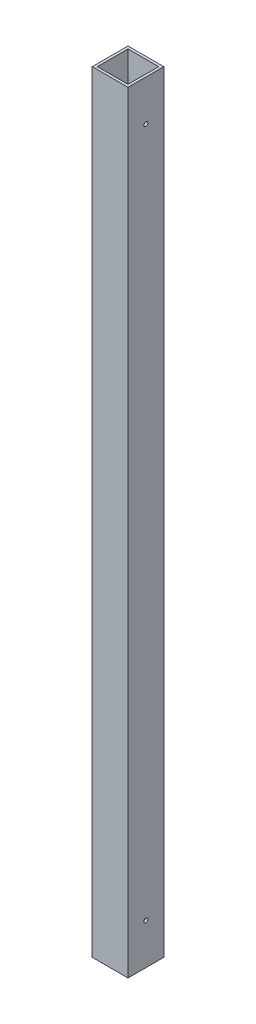
ISO-10303-21;
HEADER;
FILE_DESCRIPTION(('STEP AP214'),'2;1');
FILE_NAME('part.step','',(''),(''),'','','');
FILE_SCHEMA(('AUTOMOTIVE_DESIGN { 1 0 10303 214 1 1 1 1 }'));
ENDSEC;
DATA;
#1=APPLICATION_CONTEXT('core data for automotive mechanical design processes');
#2=APPLICATION_PROTOCOL_DEFINITION('international standard','automotive_design',2000,#1);
#3=PRODUCT_CONTEXT('',#1,'mechanical');
#4=PRODUCT('Part','Part','',(#3));
#5=PRODUCT_RELATED_PRODUCT_CATEGORY('part','',(#4));
#6=PRODUCT_DEFINITION_FORMATION('','',#4);
#7=PRODUCT_DEFINITION_CONTEXT('part definition',#1,'design');
#8=PRODUCT_DEFINITION('design','',#6,#7);
#9=PRODUCT_DEFINITION_SHAPE('','',#8);
#10=(LENGTH_UNIT() NAMED_UNIT(*) SI_UNIT(.MILLI.,.METRE.));
#11=(NAMED_UNIT(*) PLANE_ANGLE_UNIT() SI_UNIT($,.RADIAN.));
#12=(NAMED_UNIT(*) SI_UNIT($,.STERADIAN.) SOLID_ANGLE_UNIT());
#13=UNCERTAINTY_MEASURE_WITH_UNIT(LENGTH_MEASURE(1.E-05),#10,'distance_accuracy_value','');
#14=(GEOMETRIC_REPRESENTATION_CONTEXT(3) GLOBAL_UNCERTAINTY_ASSIGNED_CONTEXT((#13)) GLOBAL_UNIT_ASSIGNED_CONTEXT((#10,
#11,#12)) REPRESENTATION_CONTEXT('',''));
#15=CARTESIAN_POINT('',(0.,0.,0.));
#16=DIRECTION('',(0.,0.,1.));
#17=DIRECTION('',(1.,0.,0.));
#18=AXIS2_PLACEMENT_3D('',#15,#16,#17);
#19=CARTESIAN_POINT('',(1071.54310144857,-428.625,22.225));
#20=DIRECTION('',(1.,0.,0.));
#21=DIRECTION('',(0.,0.,-1.));
#22=AXIS2_PLACEMENT_3D('',#19,#20,#21);
#23=CYLINDRICAL_SURFACE('',#22,2.4892);
#24=CARTESIAN_POINT('',(3.17499999999993,-428.625,22.225));
#25=DIRECTION('',(1.,0.,0.));
#26=DIRECTION('',(0.,0.,-1.));
#27=AXIS2_PLACEMENT_3D('',#24,#25,#26);
#28=CIRCLE('',#27,2.4892);
#29=CARTESIAN_POINT('',(3.17499999999993,-428.625,19.7358));
#30=VERTEX_POINT('',#29);
#31=EDGE_CURVE('E17',#30,#30,#28,.T.);
#32=ORIENTED_EDGE('',*,*,#31,.T.);
#33=EDGE_LOOP('',(#32));
#34=FACE_BOUND('',#33,.T.);
#35=CARTESIAN_POINT('',(0.,-428.625,22.225));
#36=DIRECTION('',(1.,0.,0.));
#37=DIRECTION('',(0.,0.,-1.));
#38=AXIS2_PLACEMENT_3D('',#35,#36,#37);
#39=CIRCLE('',#38,2.4892);
#40=CARTESIAN_POINT('',(0.,-428.625,19.7358));
#41=VERTEX_POINT('',#40);
#42=EDGE_CURVE('E129',#41,#41,#39,.T.);
#43=ORIENTED_EDGE('',*,*,#42,.F.);
#44=EDGE_LOOP('',(#43));
#45=FACE_BOUND('',#44,.T.);
#46=ADVANCED_FACE('F14',(#34,#45),#23,.F.);
#47=CARTESIAN_POINT('',(1071.54310144857,428.625,22.225));
#48=DIRECTION('',(1.,0.,0.));
#49=DIRECTION('',(0.,0.,-1.));
#50=AXIS2_PLACEMENT_3D('',#47,#48,#49);
#51=CYLINDRICAL_SURFACE('',#50,2.4892);
#52=CARTESIAN_POINT('',(3.17499999999993,428.625,22.225));
#53=DIRECTION('',(1.,0.,0.));
#54=DIRECTION('',(0.,0.,-1.));
#55=AXIS2_PLACEMENT_3D('',#52,#53,#54);
#56=CIRCLE('',#55,2.4892);
#57=CARTESIAN_POINT('',(3.17499999999993,428.625,19.7358));
#58=VERTEX_POINT('',#57);
#59=EDGE_CURVE('E117',#58,#58,#56,.T.);
#60=ORIENTED_EDGE('',*,*,#59,.T.);
#61=EDGE_LOOP('',(#60));
#62=FACE_BOUND('',#61,.T.);
#63=CARTESIAN_POINT('',(0.,428.625,22.225));
#64=DIRECTION('',(1.,0.,0.));
#65=DIRECTION('',(0.,0.,-1.));
#66=AXIS2_PLACEMENT_3D('',#63,#64,#65);
#67=CIRCLE('',#66,2.4892);
#68=CARTESIAN_POINT('',(0.,428.625,19.7358));
#69=VERTEX_POINT('',#68);
#70=EDGE_CURVE('E125',#69,#69,#67,.T.);
#71=ORIENTED_EDGE('',*,*,#70,.F.);
#72=EDGE_LOOP('',(#71));
#73=FACE_BOUND('',#72,.T.);
#74=ADVANCED_FACE('F154',(#62,#73),#51,.F.);
#75=CARTESIAN_POINT('',(22.225,-479.425,3.175));
#76=DIRECTION('',(0.,0.,1.));
#77=DIRECTION('',(1.,0.,0.));
#78=AXIS2_PLACEMENT_3D('',#75,#76,#77);
#79=PLANE('',#78);
#80=DIRECTION('',(1.,0.,0.));
#81=VECTOR('',#80,1.);
#82=CARTESIAN_POINT('',(22.225,-479.425,3.175));
#83=LINE('',#82,#81);
#84=CARTESIAN_POINT('',(41.275,-479.425,3.175));
#85=VERTEX_POINT('',#84);
#86=CARTESIAN_POINT('',(3.175,-479.425,3.175));
#87=VERTEX_POINT('',#86);
#88=EDGE_CURVE('E305',#85,#87,#83,.F.);
#89=ORIENTED_EDGE('',*,*,#88,.F.);
#90=DIRECTION('',(0.,1.,0.));
#91=VECTOR('',#90,1.);
#92=CARTESIAN_POINT('',(41.275,-479.425,3.175));
#93=LINE('',#92,#91);
#94=CARTESIAN_POINT('',(41.275,479.425,3.175));
#95=VERTEX_POINT('',#94);
#96=EDGE_CURVE('E101',#95,#85,#93,.F.);
#97=ORIENTED_EDGE('',*,*,#96,.F.);
#98=DIRECTION('',(1.,0.,0.));
#99=VECTOR('',#98,1.);
#100=CARTESIAN_POINT('',(22.225,479.425,3.175));
#101=LINE('',#100,#99);
#102=CARTESIAN_POINT('',(3.175,479.425,3.175));
#103=VERTEX_POINT('',#102);
#104=EDGE_CURVE('E105',#95,#103,#101,.F.);
#105=ORIENTED_EDGE('',*,*,#104,.T.);
#106=DIRECTION('',(0.,1.,0.));
#107=VECTOR('',#106,1.);
#108=CARTESIAN_POINT('',(3.175,-479.425,3.175));
#109=LINE('',#108,#107);
#110=EDGE_CURVE('E115',#103,#87,#109,.F.);
#111=ORIENTED_EDGE('',*,*,#110,.T.);
#112=EDGE_LOOP('',(#89,#97,#105,#111));
#113=FACE_BOUND('',#112,.T.);
#114=ADVANCED_FACE('F145',(#113),#79,.T.);
#115=CARTESIAN_POINT('',(3.175,-479.425,22.225));
#116=DIRECTION('',(-1.,0.,0.));
#117=DIRECTION('',(0.,0.,1.));
#118=AXIS2_PLACEMENT_3D('',#115,#116,#117);
#119=PLANE('',#118);
#120=DIRECTION('',(0.,1.,0.));
#121=VECTOR('',#120,1.);
#122=CARTESIAN_POINT('',(3.175,-479.425,41.275));
#123=LINE('',#122,#121);
#124=CARTESIAN_POINT('',(3.175,479.425,41.275));
#125=VERTEX_POINT('',#124);
#126=CARTESIAN_POINT('',(3.175,-479.425,41.275));
#127=VERTEX_POINT('',#126);
#128=EDGE_CURVE('E77',#125,#127,#123,.F.);
#129=ORIENTED_EDGE('',*,*,#128,.T.);
#130=DIRECTION('',(0.,0.,-1.));
#131=VECTOR('',#130,1.);
#132=CARTESIAN_POINT('',(3.175,-479.425,22.225));
#133=LINE('',#132,#131);
#134=EDGE_CURVE('E316',#87,#127,#133,.F.);
#135=ORIENTED_EDGE('',*,*,#134,.F.);
#136=ORIENTED_EDGE('',*,*,#110,.F.);
#137=DIRECTION('',(0.,0.,-1.));
#138=VECTOR('',#137,1.);
#139=CARTESIAN_POINT('',(3.175,479.425,22.225));
#140=LINE('',#139,#138);
#141=EDGE_CURVE('E107',#103,#125,#140,.F.);
#142=ORIENTED_EDGE('',*,*,#141,.T.);
#143=EDGE_LOOP('',(#129,#135,#136,#142));
#144=FACE_BOUND('',#143,.T.);
#145=ORIENTED_EDGE('',*,*,#59,.F.);
#146=EDGE_LOOP('',(#145));
#147=FACE_BOUND('',#146,.T.);
#148=ORIENTED_EDGE('',*,*,#31,.F.);
#149=EDGE_LOOP('',(#148));
#150=FACE_BOUND('',#149,.T.);
#151=ADVANCED_FACE('F143',(#144,#147,#150),#119,.F.);
#152=CARTESIAN_POINT('',(22.225,-479.425,41.275));
#153=DIRECTION('',(0.,0.,1.));
#154=DIRECTION('',(1.,0.,0.));
#155=AXIS2_PLACEMENT_3D('',#152,#153,#154);
#156=PLANE('',#155);
#157=DIRECTION('',(0.,1.,0.));
#158=VECTOR('',#157,1.);
#159=CARTESIAN_POINT('',(41.275,-479.425,41.275));
#160=LINE('',#159,#158);
#161=CARTESIAN_POINT('',(41.275,-479.425,41.275));
#162=VERTEX_POINT('',#161);
#163=CARTESIAN_POINT('',(41.275,479.425,41.275));
#164=VERTEX_POINT('',#163);
#165=EDGE_CURVE('E83',#162,#164,#160,.T.);
#166=ORIENTED_EDGE('',*,*,#165,.F.);
#167=DIRECTION('',(1.,0.,0.));
#168=VECTOR('',#167,1.);
#169=CARTESIAN_POINT('',(22.225,-479.425,41.275));
#170=LINE('',#169,#168);
#171=EDGE_CURVE('E314',#127,#162,#170,.T.);
#172=ORIENTED_EDGE('',*,*,#171,.F.);
#173=ORIENTED_EDGE('',*,*,#128,.F.);
#174=DIRECTION('',(1.,0.,0.));
#175=VECTOR('',#174,1.);
#176=CARTESIAN_POINT('',(22.225,479.425,41.275));
#177=LINE('',#176,#175);
#178=EDGE_CURVE('E80',#125,#164,#177,.T.);
#179=ORIENTED_EDGE('',*,*,#178,.T.);
#180=EDGE_LOOP('',(#166,#172,#173,#179));
#181=FACE_BOUND('',#180,.T.);
#182=ADVANCED_FACE('F82',(#181),#156,.F.);
#183=CARTESIAN_POINT('',(41.275,-479.425,22.225));
#184=DIRECTION('',(-1.,0.,0.));
#185=DIRECTION('',(0.,0.,1.));
#186=AXIS2_PLACEMENT_3D('',#183,#184,#185);
#187=PLANE('',#186);
#188=DIRECTION('',(0.,0.,-1.));
#189=VECTOR('',#188,1.);
#190=CARTESIAN_POINT('',(41.275,-479.425,22.225));
#191=LINE('',#190,#189);
#192=EDGE_CURVE('E98',#162,#85,#191,.T.);
#193=ORIENTED_EDGE('',*,*,#192,.F.);
#194=ORIENTED_EDGE('',*,*,#165,.T.);
#195=DIRECTION('',(0.,0.,-1.));
#196=VECTOR('',#195,1.);
#197=CARTESIAN_POINT('',(41.275,479.425,22.225));
#198=LINE('',#197,#196);
#199=EDGE_CURVE('E88',#164,#95,#198,.T.);
#200=ORIENTED_EDGE('',*,*,#199,.T.);
#201=ORIENTED_EDGE('',*,*,#96,.T.);
#202=EDGE_LOOP('',(#193,#194,#200,#201));
#203=FACE_BOUND('',#202,.T.);
#204=CARTESIAN_POINT('',(41.2749999999999,428.625,22.225));
#205=DIRECTION('',(1.,0.,0.));
#206=DIRECTION('',(0.,0.,-1.));
#207=AXIS2_PLACEMENT_3D('',#204,#205,#206);
#208=CIRCLE('',#207,2.4892);
#209=CARTESIAN_POINT('',(41.2749999999999,428.625,19.7358));
#210=VERTEX_POINT('',#209);
#211=EDGE_CURVE('E111',#210,#210,#208,.T.);
#212=ORIENTED_EDGE('',*,*,#211,.T.);
#213=EDGE_LOOP('',(#212));
#214=FACE_BOUND('',#213,.T.);
#215=CARTESIAN_POINT('',(41.2749999999999,-428.625,22.225));
#216=DIRECTION('',(1.,0.,0.));
#217=DIRECTION('',(0.,0.,-1.));
#218=AXIS2_PLACEMENT_3D('',#215,#216,#217);
#219=CIRCLE('',#218,2.4892);
#220=CARTESIAN_POINT('',(41.2749999999999,-428.625,19.7358));
#221=VERTEX_POINT('',#220);
#222=EDGE_CURVE('E100',#221,#221,#219,.T.);
#223=ORIENTED_EDGE('',*,*,#222,.T.);
#224=EDGE_LOOP('',(#223));
#225=FACE_BOUND('',#224,.T.);
#226=ADVANCED_FACE('F93',(#203,#214,#225),#187,.T.);
#227=CARTESIAN_POINT('',(1071.54310144857,-428.625,22.225));
#228=DIRECTION('',(1.,0.,0.));
#229=DIRECTION('',(0.,0.,-1.));
#230=AXIS2_PLACEMENT_3D('',#227,#228,#229);
#231=CYLINDRICAL_SURFACE('',#230,2.4892);
#232=CARTESIAN_POINT('',(44.4500000000001,-428.625,22.225));
#233=DIRECTION('',(1.,0.,0.));
#234=DIRECTION('',(0.,0.,-1.));
#235=AXIS2_PLACEMENT_3D('',#232,#233,#234);
#236=CIRCLE('',#235,2.4892);
#237=CARTESIAN_POINT('',(44.4500000000001,-428.625,19.7358));
#238=VERTEX_POINT('',#237);
#239=EDGE_CURVE('E122',#238,#238,#236,.T.);
#240=ORIENTED_EDGE('',*,*,#239,.T.);
#241=EDGE_LOOP('',(#240));
#242=FACE_BOUND('',#241,.T.);
#243=ORIENTED_EDGE('',*,*,#222,.F.);
#244=EDGE_LOOP('',(#243));
#245=FACE_BOUND('',#244,.T.);
#246=ADVANCED_FACE('F187',(#242,#245),#231,.F.);
#247=CARTESIAN_POINT('',(1071.54310144857,428.625,22.225));
#248=DIRECTION('',(1.,0.,0.));
#249=DIRECTION('',(0.,0.,-1.));
#250=AXIS2_PLACEMENT_3D('',#247,#248,#249);
#251=CYLINDRICAL_SURFACE('',#250,2.4892);
#252=CARTESIAN_POINT('',(44.4500000000001,428.625,22.225));
#253=DIRECTION('',(1.,0.,0.));
#254=DIRECTION('',(0.,0.,-1.));
#255=AXIS2_PLACEMENT_3D('',#252,#253,#254);
#256=CIRCLE('',#255,2.4892);
#257=CARTESIAN_POINT('',(44.4500000000001,428.625,19.7358));
#258=VERTEX_POINT('',#257);
#259=EDGE_CURVE('E118',#258,#258,#256,.T.);
#260=ORIENTED_EDGE('',*,*,#259,.T.);
#261=EDGE_LOOP('',(#260));
#262=FACE_BOUND('',#261,.T.);
#263=ORIENTED_EDGE('',*,*,#211,.F.);
#264=EDGE_LOOP('',(#263));
#265=FACE_BOUND('',#264,.T.);
#266=ADVANCED_FACE('F183',(#262,#265),#251,.F.);
#267=CARTESIAN_POINT('',(22.225,-479.425,0.));
#268=DIRECTION('',(0.,0.,1.));
#269=DIRECTION('',(1.,0.,0.));
#270=AXIS2_PLACEMENT_3D('',#267,#268,#269);
#271=PLANE('',#270);
#272=DIRECTION('',(0.,1.,0.));
#273=VECTOR('',#272,1.);
#274=CARTESIAN_POINT('',(44.45,-479.425,0.));
#275=LINE('',#274,#273);
#276=CARTESIAN_POINT('',(44.45,479.425,0.));
#277=VERTEX_POINT('',#276);
#278=CARTESIAN_POINT('',(44.45,-479.425,0.));
#279=VERTEX_POINT('',#278);
#280=EDGE_CURVE('E121',#277,#279,#275,.F.);
#281=ORIENTED_EDGE('',*,*,#280,.T.);
#282=DIRECTION('',(1.,0.,0.));
#283=VECTOR('',#282,1.);
#284=CARTESIAN_POINT('',(22.225,-479.425,0.));
#285=LINE('',#284,#283);
#286=CARTESIAN_POINT('',(0.,-479.425,0.));
#287=VERTEX_POINT('',#286);
#288=EDGE_CURVE('E299',#287,#279,#285,.T.);
#289=ORIENTED_EDGE('',*,*,#288,.F.);
#290=DIRECTION('',(0.,1.,0.));
#291=VECTOR('',#290,1.);
#292=CARTESIAN_POINT('',(0.,-479.425,0.));
#293=LINE('',#292,#291);
#294=CARTESIAN_POINT('',(0.,479.425,0.));
#295=VERTEX_POINT('',#294);
#296=EDGE_CURVE('E322',#295,#287,#293,.F.);
#297=ORIENTED_EDGE('',*,*,#296,.F.);
#298=DIRECTION('',(1.,0.,0.));
#299=VECTOR('',#298,1.);
#300=CARTESIAN_POINT('',(22.225,479.425,0.));
#301=LINE('',#300,#299);
#302=EDGE_CURVE('E89',#295,#277,#301,.T.);
#303=ORIENTED_EDGE('',*,*,#302,.T.);
#304=EDGE_LOOP('',(#281,#289,#297,#303));
#305=FACE_BOUND('',#304,.T.);
#306=ADVANCED_FACE('F180',(#305),#271,.F.);
#307=CARTESIAN_POINT('',(22.225,479.425,22.225));
#308=DIRECTION('',(0.,-1.,0.));
#309=DIRECTION('',(0.,0.,-1.));
#310=AXIS2_PLACEMENT_3D('',#307,#308,#309);
#311=PLANE('',#310);
#312=ORIENTED_EDGE('',*,*,#104,.F.);
#313=ORIENTED_EDGE('',*,*,#199,.F.);
#314=ORIENTED_EDGE('',*,*,#178,.F.);
#315=ORIENTED_EDGE('',*,*,#141,.F.);
#316=EDGE_LOOP('',(#312,#313,#314,#315));
#317=FACE_BOUND('',#316,.T.);
#318=DIRECTION('',(1.,0.,0.));
#319=VECTOR('',#318,1.);
#320=CARTESIAN_POINT('',(22.225,479.425,44.45));
#321=LINE('',#320,#319);
#322=CARTESIAN_POINT('',(44.45,479.425,44.45));
#323=VERTEX_POINT('',#322);
#324=CARTESIAN_POINT('',(0.,479.425,44.45));
#325=VERTEX_POINT('',#324);
#326=EDGE_CURVE('E309',#323,#325,#321,.F.);
#327=ORIENTED_EDGE('',*,*,#326,.F.);
#328=DIRECTION('',(0.,0.,1.));
#329=VECTOR('',#328,1.);
#330=CARTESIAN_POINT('',(44.45,479.425,22.225));
#331=LINE('',#330,#329);
#332=EDGE_CURVE('E307',#323,#277,#331,.F.);
#333=ORIENTED_EDGE('',*,*,#332,.T.);
#334=ORIENTED_EDGE('',*,*,#302,.F.);
#335=DIRECTION('',(0.,0.,1.));
#336=VECTOR('',#335,1.);
#337=CARTESIAN_POINT('',(0.,479.425,22.225));
#338=LINE('',#337,#336);
#339=EDGE_CURVE('E128',#325,#295,#338,.F.);
#340=ORIENTED_EDGE('',*,*,#339,.F.);
#341=EDGE_LOOP('',(#327,#333,#334,#340));
#342=FACE_BOUND('',#341,.T.);
#343=ADVANCED_FACE('F103',(#317,#342),#311,.F.);
#344=CARTESIAN_POINT('',(0.,-479.425,22.225));
#345=DIRECTION('',(-1.,0.,0.));
#346=DIRECTION('',(0.,0.,1.));
#347=AXIS2_PLACEMENT_3D('',#344,#345,#346);
#348=PLANE('',#347);
#349=DIRECTION('',(0.,0.,-1.));
#350=VECTOR('',#349,1.);
#351=CARTESIAN_POINT('',(0.,-479.425,22.225));
#352=LINE('',#351,#350);
#353=CARTESIAN_POINT('',(0.,-479.425,44.45));
#354=VERTEX_POINT('',#353);
#355=EDGE_CURVE('E304',#354,#287,#352,.T.);
#356=ORIENTED_EDGE('',*,*,#355,.F.);
#357=DIRECTION('',(0.,1.,0.));
#358=VECTOR('',#357,1.);
#359=CARTESIAN_POINT('',(0.,-479.425,44.45));
#360=LINE('',#359,#358);
#361=EDGE_CURVE('E329',#325,#354,#360,.F.);
#362=ORIENTED_EDGE('',*,*,#361,.F.);
#363=ORIENTED_EDGE('',*,*,#339,.T.);
#364=ORIENTED_EDGE('',*,*,#296,.T.);
#365=EDGE_LOOP('',(#356,#362,#363,#364));
#366=FACE_BOUND('',#365,.T.);
#367=ORIENTED_EDGE('',*,*,#70,.T.);
#368=EDGE_LOOP('',(#367));
#369=FACE_BOUND('',#368,.T.);
#370=ORIENTED_EDGE('',*,*,#42,.T.);
#371=EDGE_LOOP('',(#370));
#372=FACE_BOUND('',#371,.T.);
#373=ADVANCED_FACE('F173',(#366,#369,#372),#348,.T.);
#374=CARTESIAN_POINT('',(22.225,-479.425,22.225));
#375=DIRECTION('',(0.,-1.,0.));
#376=DIRECTION('',(0.,0.,-1.));
#377=AXIS2_PLACEMENT_3D('',#374,#375,#376);
#378=PLANE('',#377);
#379=ORIENTED_EDGE('',*,*,#171,.T.);
#380=ORIENTED_EDGE('',*,*,#192,.T.);
#381=ORIENTED_EDGE('',*,*,#88,.T.);
#382=ORIENTED_EDGE('',*,*,#134,.T.);
#383=EDGE_LOOP('',(#379,#380,#381,#382));
#384=FACE_BOUND('',#383,.T.);
#385=DIRECTION('',(0.,0.,1.));
#386=VECTOR('',#385,1.);
#387=CARTESIAN_POINT('',(44.45,-479.425,22.225));
#388=LINE('',#387,#386);
#389=CARTESIAN_POINT('',(44.45,-479.425,44.45));
#390=VERTEX_POINT('',#389);
#391=EDGE_CURVE('E32',#279,#390,#388,.T.);
#392=ORIENTED_EDGE('',*,*,#391,.T.);
#393=DIRECTION('',(1.,0.,0.));
#394=VECTOR('',#393,1.);
#395=CARTESIAN_POINT('',(22.225,-479.425,44.45));
#396=LINE('',#395,#394);
#397=EDGE_CURVE('E23',#354,#390,#396,.T.);
#398=ORIENTED_EDGE('',*,*,#397,.F.);
#399=ORIENTED_EDGE('',*,*,#355,.T.);
#400=ORIENTED_EDGE('',*,*,#288,.T.);
#401=EDGE_LOOP('',(#392,#398,#399,#400));
#402=FACE_BOUND('',#401,.T.);
#403=ADVANCED_FACE('F166',(#384,#402),#378,.T.);
#404=CARTESIAN_POINT('',(44.45,-479.425,22.225));
#405=DIRECTION('',(-1.,0.,0.));
#406=DIRECTION('',(0.,0.,1.));
#407=AXIS2_PLACEMENT_3D('',#404,#405,#406);
#408=PLANE('',#407);
#409=DIRECTION('',(0.,1.,0.));
#410=VECTOR('',#409,1.);
#411=CARTESIAN_POINT('',(44.45,-479.425,44.45));
#412=LINE('',#411,#410);
#413=EDGE_CURVE('E9',#390,#323,#412,.T.);
#414=ORIENTED_EDGE('',*,*,#413,.F.);
#415=ORIENTED_EDGE('',*,*,#391,.F.);
#416=ORIENTED_EDGE('',*,*,#280,.F.);
#417=ORIENTED_EDGE('',*,*,#332,.F.);
#418=EDGE_LOOP('',(#414,#415,#416,#417));
#419=FACE_BOUND('',#418,.T.);
#420=ORIENTED_EDGE('',*,*,#259,.F.);
#421=EDGE_LOOP('',(#420));
#422=FACE_BOUND('',#421,.T.);
#423=ORIENTED_EDGE('',*,*,#239,.F.);
#424=EDGE_LOOP('',(#423));
#425=FACE_BOUND('',#424,.T.);
#426=ADVANCED_FACE('F160',(#419,#422,#425),#408,.F.);
#427=CARTESIAN_POINT('',(22.225,-479.425,44.45));
#428=DIRECTION('',(0.,0.,1.));
#429=DIRECTION('',(1.,0.,0.));
#430=AXIS2_PLACEMENT_3D('',#427,#428,#429);
#431=PLANE('',#430);
#432=ORIENTED_EDGE('',*,*,#397,.T.);
#433=ORIENTED_EDGE('',*,*,#413,.T.);
#434=ORIENTED_EDGE('',*,*,#326,.T.);
#435=ORIENTED_EDGE('',*,*,#361,.T.);
#436=EDGE_LOOP('',(#432,#433,#434,#435));
#437=FACE_BOUND('',#436,.T.);
#438=ADVANCED_FACE('F158',(#437),#431,.T.);
#439=CLOSED_SHELL('',(#46,#74,#114,#151,#182,#226,#246,#266,#306,#343,#373,#403,#426,#438));
#440=MANIFOLD_SOLID_BREP('B1',#439);
#441=ADVANCED_BREP_SHAPE_REPRESENTATION('',(#18,#440),#14);
#442=SHAPE_DEFINITION_REPRESENTATION(#9,#441);
ENDSEC;
END-ISO-10303-21;
